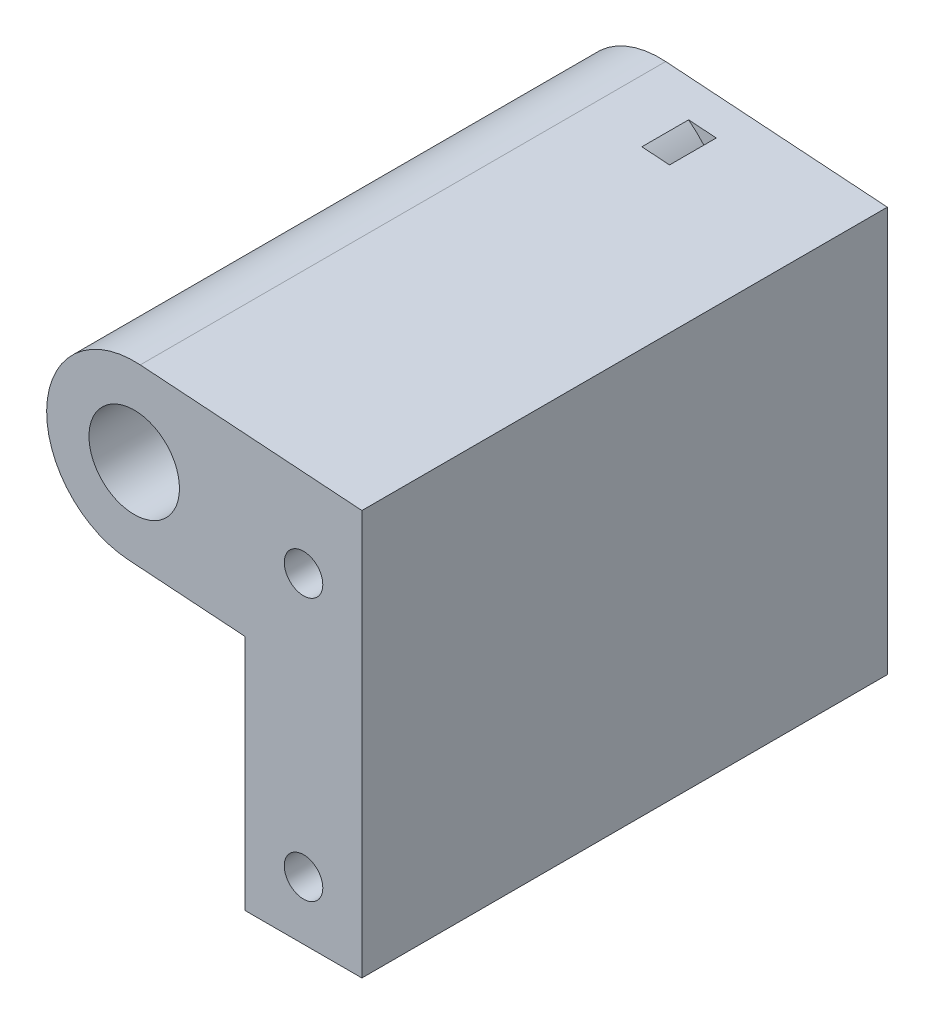
ISO-10303-21;
HEADER;
FILE_DESCRIPTION(('STEP AP214'),'2;1');
FILE_NAME('part.step','',(''),(''),'','','');
FILE_SCHEMA(('AUTOMOTIVE_DESIGN { 1 0 10303 214 1 1 1 1 }'));
ENDSEC;
DATA;
#1=APPLICATION_CONTEXT('core data for automotive mechanical design processes');
#2=APPLICATION_PROTOCOL_DEFINITION('international standard','automotive_design',2000,#1);
#3=PRODUCT_CONTEXT('',#1,'mechanical');
#4=PRODUCT('Part','Part','',(#3));
#5=PRODUCT_RELATED_PRODUCT_CATEGORY('part','',(#4));
#6=PRODUCT_DEFINITION_FORMATION('','',#4);
#7=PRODUCT_DEFINITION_CONTEXT('part definition',#1,'design');
#8=PRODUCT_DEFINITION('design','',#6,#7);
#9=PRODUCT_DEFINITION_SHAPE('','',#8);
#10=(LENGTH_UNIT() NAMED_UNIT(*) SI_UNIT(.MILLI.,.METRE.));
#11=(NAMED_UNIT(*) PLANE_ANGLE_UNIT() SI_UNIT($,.RADIAN.));
#12=(NAMED_UNIT(*) SI_UNIT($,.STERADIAN.) SOLID_ANGLE_UNIT());
#13=UNCERTAINTY_MEASURE_WITH_UNIT(LENGTH_MEASURE(1.E-05),#10,'distance_accuracy_value','');
#14=(GEOMETRIC_REPRESENTATION_CONTEXT(3) GLOBAL_UNCERTAINTY_ASSIGNED_CONTEXT((#13)) GLOBAL_UNIT_ASSIGNED_CONTEXT((#10,
#11,#12)) REPRESENTATION_CONTEXT('',''));
#15=CARTESIAN_POINT('',(0.,0.,0.));
#16=DIRECTION('',(0.,0.,1.));
#17=DIRECTION('',(1.,0.,0.));
#18=AXIS2_PLACEMENT_3D('',#15,#16,#17);
#19=CARTESIAN_POINT('',(-182.516015687115,162.517772536827,45.));
#20=DIRECTION('',(0.0688020916153644,0.997630328422984,0.));
#21=DIRECTION('',(-0.997630328422984,0.0688020916153644,0.));
#22=AXIS2_PLACEMENT_3D('',#19,#20,#21);
#23=PLANE('',#22);
#24=DIRECTION('',(0.997630328422984,-0.0688020916153644,0.));
#25=VECTOR('',#24,1.);
#26=CARTESIAN_POINT('',(-182.516015687115,162.517772536827,0.));
#27=LINE('',#26,#25);
#28=CARTESIAN_POINT('',(-182.516015687115,162.517772536827,0.));
#29=VERTEX_POINT('',#28);
#30=CARTESIAN_POINT('',(-172.5,161.827012834268,0.));
#31=VERTEX_POINT('',#30);
#32=EDGE_CURVE('E112',#29,#31,#27,.T.);
#33=ORIENTED_EDGE('',*,*,#32,.T.);
#34=DIRECTION('',(0.,0.,-1.));
#35=VECTOR('',#34,1.);
#36=CARTESIAN_POINT('',(-172.5,161.827012834268,45.));
#37=LINE('',#36,#35);
#38=CARTESIAN_POINT('',(-172.5,161.827012834268,45.));
#39=VERTEX_POINT('',#38);
#40=EDGE_CURVE('E120',#39,#31,#37,.T.);
#41=ORIENTED_EDGE('',*,*,#40,.F.);
#42=DIRECTION('',(0.997630328422984,-0.0688020916153644,0.));
#43=VECTOR('',#42,1.);
#44=CARTESIAN_POINT('',(-182.516015687115,162.517772536827,45.));
#45=LINE('',#44,#43);
#46=CARTESIAN_POINT('',(-182.516015687115,162.517772536827,45.));
#47=VERTEX_POINT('',#46);
#48=EDGE_CURVE('E114',#47,#39,#45,.T.);
#49=ORIENTED_EDGE('',*,*,#48,.F.);
#50=DIRECTION('',(0.,0.,-1.));
#51=VECTOR('',#50,1.);
#52=CARTESIAN_POINT('',(-182.516015687115,162.517772536827,45.));
#53=LINE('',#52,#51);
#54=EDGE_CURVE('E108',#47,#29,#53,.T.);
#55=ORIENTED_EDGE('',*,*,#54,.T.);
#56=EDGE_LOOP('',(#33,#41,#49,#55));
#57=FACE_BOUND('',#56,.T.);
#58=DIRECTION('',(-0.997630328422984,0.0688020916153644,0.));
#59=VECTOR('',#58,1.);
#60=CARTESIAN_POINT('',(-182.516015687115,162.517772536827,7.));
#61=LINE('',#60,#59);
#62=CARTESIAN_POINT('',(-175.184959917431,162.012182483746,7.));
#63=VERTEX_POINT('',#62);
#64=CARTESIAN_POINT('',(-177.552867468828,162.175486452808,7.));
#65=VERTEX_POINT('',#64);
#66=EDGE_CURVE('E172',#63,#65,#61,.T.);
#67=ORIENTED_EDGE('',*,*,#66,.F.);
#68=DIRECTION('',(0.,0.,-1.));
#69=VECTOR('',#68,1.);
#70=CARTESIAN_POINT('',(-175.184959917431,162.012182483746,7.));
#71=LINE('',#70,#69);
#72=CARTESIAN_POINT('',(-175.184959917431,162.012182483746,3.));
#73=VERTEX_POINT('',#72);
#74=EDGE_CURVE('E130',#63,#73,#71,.T.);
#75=ORIENTED_EDGE('',*,*,#74,.T.);
#76=DIRECTION('',(-0.997630328422984,0.0688020916153644,0.));
#77=VECTOR('',#76,1.);
#78=CARTESIAN_POINT('',(-182.516015687115,162.517772536827,3.));
#79=LINE('',#78,#77);
#80=CARTESIAN_POINT('',(-177.552867468828,162.175486452808,3.));
#81=VERTEX_POINT('',#80);
#82=EDGE_CURVE('E168',#73,#81,#79,.T.);
#83=ORIENTED_EDGE('',*,*,#82,.T.);
#84=DIRECTION('',(0.,0.,-1.));
#85=VECTOR('',#84,1.);
#86=CARTESIAN_POINT('',(-177.552867468828,162.175486452808,7.));
#87=LINE('',#86,#85);
#88=EDGE_CURVE('E162',#65,#81,#87,.T.);
#89=ORIENTED_EDGE('',*,*,#88,.F.);
#90=EDGE_LOOP('',(#67,#75,#83,#89));
#91=FACE_BOUND('',#90,.T.);
#92=ADVANCED_FACE('F35',(#57,#91),#23,.F.);
#93=CARTESIAN_POINT('',(-181.483984312885,177.482227463172,45.));
#94=DIRECTION('',(-0.0688020916153632,-0.997630328422984,0.));
#95=DIRECTION('',(0.997630328422984,-0.0688020916153632,0.));
#96=AXIS2_PLACEMENT_3D('',#93,#94,#95);
#97=PLANE('',#96);
#98=DIRECTION('',(-0.997630328422984,0.0688020916153632,0.));
#99=VECTOR('',#98,1.);
#100=CARTESIAN_POINT('',(-181.483984312885,177.482227463172,0.));
#101=LINE('',#100,#99);
#102=CARTESIAN_POINT('',(-162.5,176.172987165732,0.));
#103=VERTEX_POINT('',#102);
#104=CARTESIAN_POINT('',(-181.483984312885,177.482227463172,0.));
#105=VERTEX_POINT('',#104);
#106=EDGE_CURVE('E178',#103,#105,#101,.T.);
#107=ORIENTED_EDGE('',*,*,#106,.T.);
#108=DIRECTION('',(0.,0.,-1.));
#109=VECTOR('',#108,1.);
#110=CARTESIAN_POINT('',(-181.483984312885,177.482227463172,45.));
#111=LINE('',#110,#109);
#112=CARTESIAN_POINT('',(-181.483984312885,177.482227463172,45.));
#113=VERTEX_POINT('',#112);
#114=EDGE_CURVE('E135',#113,#105,#111,.T.);
#115=ORIENTED_EDGE('',*,*,#114,.F.);
#116=DIRECTION('',(-0.997630328422984,0.0688020916153632,0.));
#117=VECTOR('',#116,1.);
#118=CARTESIAN_POINT('',(-181.483984312885,177.482227463172,45.));
#119=LINE('',#118,#117);
#120=CARTESIAN_POINT('',(-162.5,176.172987165732,45.));
#121=VERTEX_POINT('',#120);
#122=EDGE_CURVE('E184',#121,#113,#119,.T.);
#123=ORIENTED_EDGE('',*,*,#122,.F.);
#124=DIRECTION('',(0.,0.,-1.));
#125=VECTOR('',#124,1.);
#126=CARTESIAN_POINT('',(-162.5,176.172987165732,45.));
#127=LINE('',#126,#125);
#128=EDGE_CURVE('E193',#121,#103,#127,.T.);
#129=ORIENTED_EDGE('',*,*,#128,.T.);
#130=EDGE_LOOP('',(#107,#115,#123,#129));
#131=FACE_BOUND('',#130,.T.);
#132=DIRECTION('',(0.997630328422984,-0.0688020916153632,0.));
#133=VECTOR('',#132,1.);
#134=CARTESIAN_POINT('',(-181.483984312885,177.482227463172,7.));
#135=LINE('',#134,#133);
#136=CARTESIAN_POINT('',(-176.520836094598,177.139941379152,7.));
#137=VERTEX_POINT('',#136);
#138=CARTESIAN_POINT('',(-174.1529285432,176.976637410091,7.));
#139=VERTEX_POINT('',#138);
#140=EDGE_CURVE('E11',#137,#139,#135,.T.);
#141=ORIENTED_EDGE('',*,*,#140,.F.);
#142=DIRECTION('',(0.,0.,-1.));
#143=VECTOR('',#142,1.);
#144=CARTESIAN_POINT('',(-176.520836094598,177.139941379152,7.));
#145=LINE('',#144,#143);
#146=CARTESIAN_POINT('',(-176.520836094598,177.139941379152,3.));
#147=VERTEX_POINT('',#146);
#148=EDGE_CURVE('E165',#137,#147,#145,.T.);
#149=ORIENTED_EDGE('',*,*,#148,.T.);
#150=DIRECTION('',(0.997630328422984,-0.0688020916153632,0.));
#151=VECTOR('',#150,1.);
#152=CARTESIAN_POINT('',(-181.483984312885,177.482227463172,3.));
#153=LINE('',#152,#151);
#154=CARTESIAN_POINT('',(-174.1529285432,176.976637410091,3.));
#155=VERTEX_POINT('',#154);
#156=EDGE_CURVE('E119',#147,#155,#153,.T.);
#157=ORIENTED_EDGE('',*,*,#156,.T.);
#158=DIRECTION('',(0.,0.,-1.));
#159=VECTOR('',#158,1.);
#160=CARTESIAN_POINT('',(-174.1529285432,176.976637410091,7.));
#161=LINE('',#160,#159);
#162=EDGE_CURVE('E42',#155,#139,#161,.F.);
#163=ORIENTED_EDGE('',*,*,#162,.T.);
#164=EDGE_LOOP('',(#141,#149,#157,#163));
#165=FACE_BOUND('',#164,.T.);
#166=ADVANCED_FACE('F207',(#131,#165),#97,.F.);
#167=CARTESIAN_POINT('',(-172.5,161.827012834268,45.));
#168=DIRECTION('',(1.,0.,0.));
#169=DIRECTION('',(0.,0.,-1.));
#170=AXIS2_PLACEMENT_3D('',#167,#168,#169);
#171=PLANE('',#170);
#172=DIRECTION('',(0.,-1.,0.));
#173=VECTOR('',#172,1.);
#174=CARTESIAN_POINT('',(-172.5,161.827012834268,0.));
#175=LINE('',#174,#173);
#176=CARTESIAN_POINT('',(-172.5,141.5,0.));
#177=VERTEX_POINT('',#176);
#178=EDGE_CURVE('E129',#31,#177,#175,.T.);
#179=ORIENTED_EDGE('',*,*,#178,.T.);
#180=DIRECTION('',(0.,0.,-1.));
#181=VECTOR('',#180,1.);
#182=CARTESIAN_POINT('',(-172.5,141.5,45.));
#183=LINE('',#182,#181);
#184=CARTESIAN_POINT('',(-172.5,141.5,45.));
#185=VERTEX_POINT('',#184);
#186=EDGE_CURVE('E199',#185,#177,#183,.T.);
#187=ORIENTED_EDGE('',*,*,#186,.F.);
#188=DIRECTION('',(0.,-1.,0.));
#189=VECTOR('',#188,1.);
#190=CARTESIAN_POINT('',(-172.5,161.827012834268,45.));
#191=LINE('',#190,#189);
#192=EDGE_CURVE('E177',#39,#185,#191,.T.);
#193=ORIENTED_EDGE('',*,*,#192,.F.);
#194=ORIENTED_EDGE('',*,*,#40,.T.);
#195=EDGE_LOOP('',(#179,#187,#193,#194));
#196=FACE_BOUND('',#195,.T.);
#197=ADVANCED_FACE('F235',(#196),#171,.F.);
#198=CARTESIAN_POINT('',(-172.5,141.5,45.));
#199=DIRECTION('',(0.,1.,0.));
#200=DIRECTION('',(0.,0.,1.));
#201=AXIS2_PLACEMENT_3D('',#198,#199,#200);
#202=PLANE('',#201);
#203=DIRECTION('',(1.,0.,0.));
#204=VECTOR('',#203,1.);
#205=CARTESIAN_POINT('',(-172.5,141.5,0.));
#206=LINE('',#205,#204);
#207=CARTESIAN_POINT('',(-162.5,141.5,0.));
#208=VERTEX_POINT('',#207);
#209=EDGE_CURVE('E187',#177,#208,#206,.T.);
#210=ORIENTED_EDGE('',*,*,#209,.T.);
#211=DIRECTION('',(0.,0.,-1.));
#212=VECTOR('',#211,1.);
#213=CARTESIAN_POINT('',(-162.5,141.5,45.));
#214=LINE('',#213,#212);
#215=CARTESIAN_POINT('',(-162.5,141.5,45.));
#216=VERTEX_POINT('',#215);
#217=EDGE_CURVE('E196',#216,#208,#214,.T.);
#218=ORIENTED_EDGE('',*,*,#217,.F.);
#219=DIRECTION('',(1.,0.,0.));
#220=VECTOR('',#219,1.);
#221=CARTESIAN_POINT('',(-172.5,141.5,45.));
#222=LINE('',#221,#220);
#223=EDGE_CURVE('E180',#185,#216,#222,.T.);
#224=ORIENTED_EDGE('',*,*,#223,.F.);
#225=ORIENTED_EDGE('',*,*,#186,.T.);
#226=EDGE_LOOP('',(#210,#218,#224,#225));
#227=FACE_BOUND('',#226,.T.);
#228=ADVANCED_FACE('F241',(#227),#202,.F.);
#229=CARTESIAN_POINT('',(-162.5,176.172987165732,45.));
#230=DIRECTION('',(-1.,0.,0.));
#231=DIRECTION('',(0.,0.,1.));
#232=AXIS2_PLACEMENT_3D('',#229,#230,#231);
#233=PLANE('',#232);
#234=DIRECTION('',(0.,1.,0.));
#235=VECTOR('',#234,1.);
#236=CARTESIAN_POINT('',(-162.5,176.172987165732,0.));
#237=LINE('',#236,#235);
#238=EDGE_CURVE('E189',#208,#103,#237,.T.);
#239=ORIENTED_EDGE('',*,*,#238,.T.);
#240=ORIENTED_EDGE('',*,*,#128,.F.);
#241=DIRECTION('',(0.,1.,0.));
#242=VECTOR('',#241,1.);
#243=CARTESIAN_POINT('',(-162.5,176.172987165732,45.));
#244=LINE('',#243,#242);
#245=EDGE_CURVE('E182',#216,#121,#244,.T.);
#246=ORIENTED_EDGE('',*,*,#245,.F.);
#247=ORIENTED_EDGE('',*,*,#217,.T.);
#248=EDGE_LOOP('',(#239,#240,#246,#247));
#249=FACE_BOUND('',#248,.T.);
#250=ADVANCED_FACE('F246',(#249),#233,.F.);
#251=CARTESIAN_POINT('',(-182.,170.,45.));
#252=DIRECTION('',(0.,0.,1.));
#253=DIRECTION('',(1.,0.,0.));
#254=AXIS2_PLACEMENT_3D('',#251,#252,#253);
#255=PLANE('',#254);
#256=CARTESIAN_POINT('',(-182.,170.,45.));
#257=DIRECTION('',(0.,0.,1.));
#258=DIRECTION('',(1.,0.,0.));
#259=AXIS2_PLACEMENT_3D('',#256,#257,#258);
#260=CIRCLE('',#259,3.87499999999999);
#261=CARTESIAN_POINT('',(-178.125,170.,45.));
#262=VERTEX_POINT('',#261);
#263=EDGE_CURVE('E145',#262,#262,#260,.T.);
#264=ORIENTED_EDGE('',*,*,#263,.F.);
#265=EDGE_LOOP('',(#264));
#266=FACE_BOUND('',#265,.T.);
#267=CARTESIAN_POINT('',(-167.5,169.,45.));
#268=DIRECTION('',(0.,0.,1.));
#269=DIRECTION('',(1.,0.,0.));
#270=AXIS2_PLACEMENT_3D('',#267,#268,#269);
#271=CIRCLE('',#270,1.64999999999998);
#272=CARTESIAN_POINT('',(-165.85,169.,45.));
#273=VERTEX_POINT('',#272);
#274=EDGE_CURVE('E136',#273,#273,#271,.T.);
#275=ORIENTED_EDGE('',*,*,#274,.F.);
#276=EDGE_LOOP('',(#275));
#277=FACE_BOUND('',#276,.T.);
#278=CARTESIAN_POINT('',(-167.5,146.5,45.));
#279=DIRECTION('',(0.,0.,1.));
#280=DIRECTION('',(1.,0.,0.));
#281=AXIS2_PLACEMENT_3D('',#278,#279,#280);
#282=CIRCLE('',#281,1.64999999999998);
#283=CARTESIAN_POINT('',(-165.85,146.5,45.));
#284=VERTEX_POINT('',#283);
#285=EDGE_CURVE('E150',#284,#284,#282,.T.);
#286=ORIENTED_EDGE('',*,*,#285,.F.);
#287=EDGE_LOOP('',(#286));
#288=FACE_BOUND('',#287,.T.);
#289=ORIENTED_EDGE('',*,*,#122,.T.);
#290=CARTESIAN_POINT('',(-182.,170.,45.));
#291=DIRECTION('',(0.,0.,1.));
#292=DIRECTION('',(1.,0.,0.));
#293=AXIS2_PLACEMENT_3D('',#290,#291,#292);
#294=CIRCLE('',#293,7.49999999999999);
#295=EDGE_CURVE('E137',#113,#47,#294,.T.);
#296=ORIENTED_EDGE('',*,*,#295,.T.);
#297=ORIENTED_EDGE('',*,*,#48,.T.);
#298=ORIENTED_EDGE('',*,*,#192,.T.);
#299=ORIENTED_EDGE('',*,*,#223,.T.);
#300=ORIENTED_EDGE('',*,*,#245,.T.);
#301=EDGE_LOOP('',(#289,#296,#297,#298,#299,#300));
#302=FACE_BOUND('',#301,.T.);
#303=ADVANCED_FACE('F249',(#266,#277,#288,#302),#255,.T.);
#304=CARTESIAN_POINT('',(-182.,170.,0.));
#305=DIRECTION('',(0.,0.,1.));
#306=DIRECTION('',(1.,0.,0.));
#307=AXIS2_PLACEMENT_3D('',#304,#305,#306);
#308=PLANE('',#307);
#309=CARTESIAN_POINT('',(-182.,170.,0.));
#310=DIRECTION('',(0.,0.,1.));
#311=DIRECTION('',(1.,0.,0.));
#312=AXIS2_PLACEMENT_3D('',#309,#310,#311);
#313=CIRCLE('',#312,3.87499999999999);
#314=CARTESIAN_POINT('',(-178.125,170.,0.));
#315=VERTEX_POINT('',#314);
#316=EDGE_CURVE('E142',#315,#315,#313,.T.);
#317=ORIENTED_EDGE('',*,*,#316,.T.);
#318=EDGE_LOOP('',(#317));
#319=FACE_BOUND('',#318,.T.);
#320=CARTESIAN_POINT('',(-167.5,169.,0.));
#321=DIRECTION('',(0.,0.,1.));
#322=DIRECTION('',(1.,0.,0.));
#323=AXIS2_PLACEMENT_3D('',#320,#321,#322);
#324=CIRCLE('',#323,1.64999999999998);
#325=CARTESIAN_POINT('',(-165.85,169.,0.));
#326=VERTEX_POINT('',#325);
#327=EDGE_CURVE('E140',#326,#326,#324,.T.);
#328=ORIENTED_EDGE('',*,*,#327,.T.);
#329=EDGE_LOOP('',(#328));
#330=FACE_BOUND('',#329,.T.);
#331=CARTESIAN_POINT('',(-167.5,146.5,0.));
#332=DIRECTION('',(0.,0.,1.));
#333=DIRECTION('',(1.,0.,0.));
#334=AXIS2_PLACEMENT_3D('',#331,#332,#333);
#335=CIRCLE('',#334,1.64999999999998);
#336=CARTESIAN_POINT('',(-165.85,146.5,0.));
#337=VERTEX_POINT('',#336);
#338=EDGE_CURVE('E153',#337,#337,#335,.T.);
#339=ORIENTED_EDGE('',*,*,#338,.T.);
#340=EDGE_LOOP('',(#339));
#341=FACE_BOUND('',#340,.T.);
#342=ORIENTED_EDGE('',*,*,#32,.F.);
#343=CARTESIAN_POINT('',(-182.,170.,0.));
#344=DIRECTION('',(0.,0.,1.));
#345=DIRECTION('',(1.,0.,0.));
#346=AXIS2_PLACEMENT_3D('',#343,#344,#345);
#347=CIRCLE('',#346,7.49999999999999);
#348=EDGE_CURVE('E127',#105,#29,#347,.T.);
#349=ORIENTED_EDGE('',*,*,#348,.F.);
#350=ORIENTED_EDGE('',*,*,#106,.F.);
#351=ORIENTED_EDGE('',*,*,#238,.F.);
#352=ORIENTED_EDGE('',*,*,#209,.F.);
#353=ORIENTED_EDGE('',*,*,#178,.F.);
#354=EDGE_LOOP('',(#342,#349,#350,#351,#352,#353));
#355=FACE_BOUND('',#354,.T.);
#356=ADVANCED_FACE('F125',(#319,#330,#341,#355),#308,.F.);
#357=CARTESIAN_POINT('',(-182.,170.,7.));
#358=DIRECTION('',(0.,0.,-1.));
#359=DIRECTION('',(-1.,0.,0.));
#360=AXIS2_PLACEMENT_3D('',#357,#358,#359);
#361=CYLINDRICAL_SURFACE('',#360,10.5);
#362=CARTESIAN_POINT('',(-182.,170.,7.));
#363=DIRECTION('',(0.,0.,-1.));
#364=DIRECTION('',(-1.,0.,0.));
#365=AXIS2_PLACEMENT_3D('',#362,#363,#364);
#366=CIRCLE('',#365,10.5);
#367=EDGE_CURVE('E156',#139,#63,#366,.T.);
#368=ORIENTED_EDGE('',*,*,#367,.F.);
#369=ORIENTED_EDGE('',*,*,#162,.F.);
#370=CARTESIAN_POINT('',(-182.,170.,3.));
#371=DIRECTION('',(0.,0.,-1.));
#372=DIRECTION('',(-1.,0.,0.));
#373=AXIS2_PLACEMENT_3D('',#370,#371,#372);
#374=CIRCLE('',#373,10.5);
#375=EDGE_CURVE('E54',#155,#73,#374,.T.);
#376=ORIENTED_EDGE('',*,*,#375,.T.);
#377=ORIENTED_EDGE('',*,*,#74,.F.);
#378=EDGE_LOOP('',(#368,#369,#376,#377));
#379=FACE_BOUND('',#378,.T.);
#380=ADVANCED_FACE('F210',(#379),#361,.F.);
#381=CARTESIAN_POINT('',(-179.03211955124,173.867468247041,7.));
#382=DIRECTION('',(0.,0.,-1.));
#383=DIRECTION('',(-1.,0.,0.));
#384=AXIS2_PLACEMENT_3D('',#381,#382,#383);
#385=PLANE('',#384);
#386=ORIENTED_EDGE('',*,*,#66,.T.);
#387=CARTESIAN_POINT('',(-182.,170.,7.));
#388=DIRECTION('',(0.,0.,1.));
#389=DIRECTION('',(-1.,0.,0.));
#390=AXIS2_PLACEMENT_3D('',#387,#388,#389);
#391=CIRCLE('',#390,9.);
#392=EDGE_CURVE('E159',#65,#137,#391,.T.);
#393=ORIENTED_EDGE('',*,*,#392,.T.);
#394=ORIENTED_EDGE('',*,*,#140,.T.);
#395=ORIENTED_EDGE('',*,*,#367,.T.);
#396=EDGE_LOOP('',(#386,#393,#394,#395));
#397=FACE_BOUND('',#396,.T.);
#398=ADVANCED_FACE('F213',(#397),#385,.T.);
#399=CARTESIAN_POINT('',(-179.03211955124,173.867468247041,3.));
#400=DIRECTION('',(0.,0.,-1.));
#401=DIRECTION('',(-1.,0.,0.));
#402=AXIS2_PLACEMENT_3D('',#399,#400,#401);
#403=PLANE('',#402);
#404=ORIENTED_EDGE('',*,*,#375,.F.);
#405=ORIENTED_EDGE('',*,*,#156,.F.);
#406=CARTESIAN_POINT('',(-182.,170.,3.));
#407=DIRECTION('',(0.,0.,1.));
#408=DIRECTION('',(-1.,0.,0.));
#409=AXIS2_PLACEMENT_3D('',#406,#407,#408);
#410=CIRCLE('',#409,9.);
#411=EDGE_CURVE('E49',#81,#147,#410,.T.);
#412=ORIENTED_EDGE('',*,*,#411,.F.);
#413=ORIENTED_EDGE('',*,*,#82,.F.);
#414=EDGE_LOOP('',(#404,#405,#412,#413));
#415=FACE_BOUND('',#414,.T.);
#416=ADVANCED_FACE('F220',(#415),#403,.F.);
#417=CARTESIAN_POINT('',(-182.,170.,7.));
#418=DIRECTION('',(0.,0.,-1.));
#419=DIRECTION('',(-1.,0.,0.));
#420=AXIS2_PLACEMENT_3D('',#417,#418,#419);
#421=CYLINDRICAL_SURFACE('',#420,9.);
#422=ORIENTED_EDGE('',*,*,#411,.T.);
#423=ORIENTED_EDGE('',*,*,#148,.F.);
#424=ORIENTED_EDGE('',*,*,#392,.F.);
#425=ORIENTED_EDGE('',*,*,#88,.T.);
#426=EDGE_LOOP('',(#422,#423,#424,#425));
#427=FACE_BOUND('',#426,.T.);
#428=ADVANCED_FACE('F217',(#427),#421,.T.);
#429=CARTESIAN_POINT('',(-167.5,146.5,45.));
#430=DIRECTION('',(0.,0.,1.));
#431=DIRECTION('',(1.,0.,0.));
#432=AXIS2_PLACEMENT_3D('',#429,#430,#431);
#433=CYLINDRICAL_SURFACE('',#432,1.64999999999998);
#434=ORIENTED_EDGE('',*,*,#338,.F.);
#435=EDGE_LOOP('',(#434));
#436=FACE_BOUND('',#435,.T.);
#437=ORIENTED_EDGE('',*,*,#285,.T.);
#438=EDGE_LOOP('',(#437));
#439=FACE_BOUND('',#438,.T.);
#440=ADVANCED_FACE('F219',(#436,#439),#433,.F.);
#441=CARTESIAN_POINT('',(-167.5,169.,45.));
#442=DIRECTION('',(0.,0.,1.));
#443=DIRECTION('',(1.,0.,0.));
#444=AXIS2_PLACEMENT_3D('',#441,#442,#443);
#445=CYLINDRICAL_SURFACE('',#444,1.64999999999998);
#446=ORIENTED_EDGE('',*,*,#327,.F.);
#447=EDGE_LOOP('',(#446));
#448=FACE_BOUND('',#447,.T.);
#449=ORIENTED_EDGE('',*,*,#274,.T.);
#450=EDGE_LOOP('',(#449));
#451=FACE_BOUND('',#450,.T.);
#452=ADVANCED_FACE('F226',(#448,#451),#445,.F.);
#453=CARTESIAN_POINT('',(-182.,170.,0.));
#454=DIRECTION('',(0.,0.,1.));
#455=DIRECTION('',(1.,0.,0.));
#456=AXIS2_PLACEMENT_3D('',#453,#454,#455);
#457=CYLINDRICAL_SURFACE('',#456,7.49999999999999);
#458=ORIENTED_EDGE('',*,*,#348,.T.);
#459=ORIENTED_EDGE('',*,*,#54,.F.);
#460=ORIENTED_EDGE('',*,*,#295,.F.);
#461=ORIENTED_EDGE('',*,*,#114,.T.);
#462=EDGE_LOOP('',(#458,#459,#460,#461));
#463=FACE_BOUND('',#462,.T.);
#464=ADVANCED_FACE('F133',(#463),#457,.T.);
#465=CARTESIAN_POINT('',(-182.,170.,0.));
#466=DIRECTION('',(0.,0.,1.));
#467=DIRECTION('',(1.,0.,0.));
#468=AXIS2_PLACEMENT_3D('',#465,#466,#467);
#469=CYLINDRICAL_SURFACE('',#468,3.87499999999999);
#470=ORIENTED_EDGE('',*,*,#316,.F.);
#471=EDGE_LOOP('',(#470));
#472=FACE_BOUND('',#471,.T.);
#473=ORIENTED_EDGE('',*,*,#263,.T.);
#474=EDGE_LOOP('',(#473));
#475=FACE_BOUND('',#474,.T.);
#476=ADVANCED_FACE('F285',(#472,#475),#469,.F.);
#477=CLOSED_SHELL('',(#92,#166,#197,#228,#250,#303,#356,#380,#398,#416,#428,#440,#452,#464,#476));
#478=MANIFOLD_SOLID_BREP('B2',#477);
#479=ADVANCED_BREP_SHAPE_REPRESENTATION('',(#18,#478),#14);
#480=SHAPE_DEFINITION_REPRESENTATION(#9,#479);
ENDSEC;
END-ISO-10303-21;
